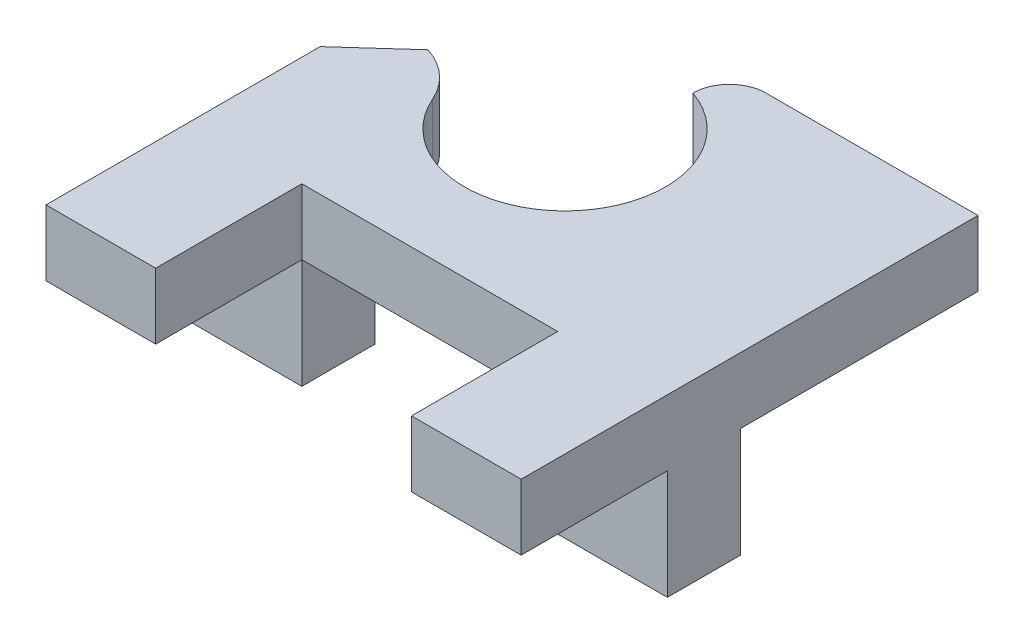
ISO-10303-21;
HEADER;
FILE_DESCRIPTION(('STEP AP214'),'2;1');
FILE_NAME('part.step','',(''),(''),'','','');
FILE_SCHEMA(('AUTOMOTIVE_DESIGN { 1 0 10303 214 1 1 1 1 }'));
ENDSEC;
DATA;
#1=APPLICATION_CONTEXT('core data for automotive mechanical design processes');
#2=APPLICATION_PROTOCOL_DEFINITION('international standard','automotive_design',2000,#1);
#3=PRODUCT_CONTEXT('',#1,'mechanical');
#4=PRODUCT('Part','Part','',(#3));
#5=PRODUCT_RELATED_PRODUCT_CATEGORY('part','',(#4));
#6=PRODUCT_DEFINITION_FORMATION('','',#4);
#7=PRODUCT_DEFINITION_CONTEXT('part definition',#1,'design');
#8=PRODUCT_DEFINITION('design','',#6,#7);
#9=PRODUCT_DEFINITION_SHAPE('','',#8);
#10=(LENGTH_UNIT() NAMED_UNIT(*) SI_UNIT(.MILLI.,.METRE.));
#11=(NAMED_UNIT(*) PLANE_ANGLE_UNIT() SI_UNIT($,.RADIAN.));
#12=(NAMED_UNIT(*) SI_UNIT($,.STERADIAN.) SOLID_ANGLE_UNIT());
#13=UNCERTAINTY_MEASURE_WITH_UNIT(LENGTH_MEASURE(1.E-05),#10,'distance_accuracy_value','');
#14=(GEOMETRIC_REPRESENTATION_CONTEXT(3) GLOBAL_UNCERTAINTY_ASSIGNED_CONTEXT((#13)) GLOBAL_UNIT_ASSIGNED_CONTEXT((#10,
#11,#12)) REPRESENTATION_CONTEXT('',''));
#15=CARTESIAN_POINT('',(0.,0.,0.));
#16=DIRECTION('',(0.,0.,1.));
#17=DIRECTION('',(1.,0.,0.));
#18=AXIS2_PLACEMENT_3D('',#15,#16,#17);
#19=CARTESIAN_POINT('',(-1.2,0.,-4.9));
#20=DIRECTION('',(0.,1.,0.));
#21=DIRECTION('',(0.,0.,1.));
#22=AXIS2_PLACEMENT_3D('',#19,#20,#21);
#23=PLANE('',#22);
#24=DIRECTION('',(-1.,0.,0.));
#25=VECTOR('',#24,1.);
#26=CARTESIAN_POINT('',(-3.5,0.,0.));
#27=LINE('',#26,#25);
#28=CARTESIAN_POINT('',(-3.5,0.,0.));
#29=VERTEX_POINT('',#28);
#30=CARTESIAN_POINT('',(-6.5,0.,0.));
#31=VERTEX_POINT('',#30);
#32=EDGE_CURVE('E476',#29,#31,#27,.T.);
#33=ORIENTED_EDGE('',*,*,#32,.F.);
#34=DIRECTION('',(0.,0.,-1.));
#35=VECTOR('',#34,1.);
#36=CARTESIAN_POINT('',(-3.5,0.,0.));
#37=LINE('',#36,#35);
#38=CARTESIAN_POINT('',(-3.5,0.,4.));
#39=VERTEX_POINT('',#38);
#40=EDGE_CURVE('E253',#39,#29,#37,.T.);
#41=ORIENTED_EDGE('',*,*,#40,.F.);
#42=DIRECTION('',(1.,0.,0.));
#43=VECTOR('',#42,1.);
#44=CARTESIAN_POINT('',(-6.5,0.,4.));
#45=LINE('',#44,#43);
#46=CARTESIAN_POINT('',(-6.5,0.,4.));
#47=VERTEX_POINT('',#46);
#48=EDGE_CURVE('E251',#47,#39,#45,.T.);
#49=ORIENTED_EDGE('',*,*,#48,.F.);
#50=DIRECTION('',(0.,0.,1.));
#51=VECTOR('',#50,1.);
#52=CARTESIAN_POINT('',(-6.5,0.,0.));
#53=LINE('',#52,#51);
#54=EDGE_CURVE('E247',#31,#47,#53,.T.);
#55=ORIENTED_EDGE('',*,*,#54,.F.);
#56=EDGE_LOOP('',(#33,#41,#49,#55));
#57=FACE_BOUND('',#56,.T.);
#58=ADVANCED_FACE('F33',(#57),#23,.F.);
#59=DIRECTION('',(0.,0.,1.));
#60=VECTOR('',#59,1.);
#61=CARTESIAN_POINT('',(-3.5,0.,0.));
#62=LINE('',#61,#60);
#63=CARTESIAN_POINT('',(-3.5,0.,-2.));
#64=VERTEX_POINT('',#63);
#65=EDGE_CURVE('E183',#64,#29,#62,.T.);
#66=ORIENTED_EDGE('',*,*,#65,.F.);
#67=DIRECTION('',(1.,0.,0.));
#68=VECTOR('',#67,1.);
#69=CARTESIAN_POINT('',(-3.5,0.,-2.));
#70=LINE('',#69,#68);
#71=CARTESIAN_POINT('',(-6.5,0.,-2.));
#72=VERTEX_POINT('',#71);
#73=EDGE_CURVE('E179',#72,#64,#70,.T.);
#74=ORIENTED_EDGE('',*,*,#73,.F.);
#75=CARTESIAN_POINT('',(-6.5,0.,-3.5));
#76=VERTEX_POINT('',#75);
#77=EDGE_CURVE('E248',#76,#72,#53,.T.);
#78=ORIENTED_EDGE('',*,*,#77,.F.);
#79=DIRECTION('',(-0.742102642751139,0.,0.67028625796877));
#80=VECTOR('',#79,1.);
#81=CARTESIAN_POINT('',(-4.95,0.,-4.9));
#82=LINE('',#81,#80);
#83=CARTESIAN_POINT('',(-4.95,0.,-4.9));
#84=VERTEX_POINT('',#83);
#85=EDGE_CURVE('E244',#84,#76,#82,.T.);
#86=ORIENTED_EDGE('',*,*,#85,.F.);
#87=CARTESIAN_POINT('',(-5.55,0.,-2.99212159716611));
#88=DIRECTION('',(0.,1.,0.));
#89=DIRECTION('',(0.,0.,1.));
#90=AXIS2_PLACEMENT_3D('',#87,#88,#89);
#91=CIRCLE('',#90,2.);
#92=CARTESIAN_POINT('',(-3.71842105263158,0.,-3.79543881941196));
#93=VERTEX_POINT('',#92);
#94=EDGE_CURVE('E299',#84,#93,#91,.F.);
#95=ORIENTED_EDGE('',*,*,#94,.T.);
#96=CARTESIAN_POINT('',(-1.2,0.,-4.9));
#97=DIRECTION('',(0.,-1.,0.));
#98=DIRECTION('',(0.,0.,1.));
#99=AXIS2_PLACEMENT_3D('',#96,#97,#98);
#100=CIRCLE('',#99,2.75);
#101=CARTESIAN_POINT('',(-0.3,0.,-7.49855729203726));
#102=VERTEX_POINT('',#101);
#103=EDGE_CURVE('E217',#102,#93,#100,.T.);
#104=ORIENTED_EDGE('',*,*,#103,.F.);
#105=CARTESIAN_POINT('',(0.7,0.,-7.49855729203726));
#106=DIRECTION('',(0.,1.,0.));
#107=DIRECTION('',(0.,0.,1.));
#108=AXIS2_PLACEMENT_3D('',#105,#106,#107);
#109=CIRCLE('',#108,1.);
#110=CARTESIAN_POINT('',(0.7,0.,-8.49855729203726));
#111=VERTEX_POINT('',#110);
#112=EDGE_CURVE('E305',#102,#111,#109,.F.);
#113=ORIENTED_EDGE('',*,*,#112,.T.);
#114=DIRECTION('',(-1.,0.,0.));
#115=VECTOR('',#114,1.);
#116=CARTESIAN_POINT('',(-0.3,0.,-8.49855729203726));
#117=LINE('',#116,#115);
#118=CARTESIAN_POINT('',(6.5,0.,-8.49855729203726));
#119=VERTEX_POINT('',#118);
#120=EDGE_CURVE('E222',#119,#111,#117,.T.);
#121=ORIENTED_EDGE('',*,*,#120,.F.);
#122=DIRECTION('',(0.,0.,-1.));
#123=VECTOR('',#122,1.);
#124=CARTESIAN_POINT('',(6.5,0.,-8.49855729203726));
#125=LINE('',#124,#123);
#126=CARTESIAN_POINT('',(6.5,0.,-2.));
#127=VERTEX_POINT('',#126);
#128=EDGE_CURVE('E264',#127,#119,#125,.T.);
#129=ORIENTED_EDGE('',*,*,#128,.F.);
#130=DIRECTION('',(1.,0.,0.));
#131=VECTOR('',#130,1.);
#132=CARTESIAN_POINT('',(3.5,0.,-2.));
#133=LINE('',#132,#131);
#134=CARTESIAN_POINT('',(3.5,0.,-2.));
#135=VERTEX_POINT('',#134);
#136=EDGE_CURVE('E56',#135,#127,#133,.T.);
#137=ORIENTED_EDGE('',*,*,#136,.F.);
#138=DIRECTION('',(0.,0.,-1.));
#139=VECTOR('',#138,1.);
#140=CARTESIAN_POINT('',(3.5,0.,0.));
#141=LINE('',#140,#139);
#142=CARTESIAN_POINT('',(3.5,0.,0.));
#143=VERTEX_POINT('',#142);
#144=EDGE_CURVE('E185',#143,#135,#141,.T.);
#145=ORIENTED_EDGE('',*,*,#144,.F.);
#146=DIRECTION('',(1.,0.,0.));
#147=VECTOR('',#146,1.);
#148=CARTESIAN_POINT('',(3.5,0.,0.));
#149=LINE('',#148,#147);
#150=EDGE_CURVE('E256',#29,#143,#149,.T.);
#151=ORIENTED_EDGE('',*,*,#150,.F.);
#152=EDGE_LOOP('',(#66,#74,#78,#86,#95,#104,#113,#121,#129,#137,#145,#151));
#153=FACE_BOUND('',#152,.T.);
#154=ADVANCED_FACE('F332',(#153),#23,.F.);
#155=DIRECTION('',(-1.,0.,0.));
#156=VECTOR('',#155,1.);
#157=CARTESIAN_POINT('',(3.5,0.,0.));
#158=LINE('',#157,#156);
#159=CARTESIAN_POINT('',(6.5,0.,0.));
#160=VERTEX_POINT('',#159);
#161=EDGE_CURVE('E197',#160,#143,#158,.T.);
#162=ORIENTED_EDGE('',*,*,#161,.F.);
#163=CARTESIAN_POINT('',(6.5,0.,4.));
#164=VERTEX_POINT('',#163);
#165=EDGE_CURVE('E265',#164,#160,#125,.T.);
#166=ORIENTED_EDGE('',*,*,#165,.F.);
#167=DIRECTION('',(1.,0.,0.));
#168=VECTOR('',#167,1.);
#169=CARTESIAN_POINT('',(6.5,0.,4.));
#170=LINE('',#169,#168);
#171=CARTESIAN_POINT('',(3.5,0.,4.));
#172=VERTEX_POINT('',#171);
#173=EDGE_CURVE('E261',#172,#164,#170,.T.);
#174=ORIENTED_EDGE('',*,*,#173,.F.);
#175=DIRECTION('',(0.,0.,1.));
#176=VECTOR('',#175,1.);
#177=CARTESIAN_POINT('',(3.5,0.,0.));
#178=LINE('',#177,#176);
#179=EDGE_CURVE('E259',#143,#172,#178,.T.);
#180=ORIENTED_EDGE('',*,*,#179,.F.);
#181=EDGE_LOOP('',(#162,#166,#174,#180));
#182=FACE_BOUND('',#181,.T.);
#183=ADVANCED_FACE('F379',(#182),#23,.F.);
#184=CARTESIAN_POINT('',(-1.2,1.8,-4.9));
#185=DIRECTION('',(0.,-1.,0.));
#186=DIRECTION('',(0.,0.,-1.));
#187=AXIS2_PLACEMENT_3D('',#184,#185,#186);
#188=CYLINDRICAL_SURFACE('',#187,2.75);
#189=ORIENTED_EDGE('',*,*,#103,.T.);
#190=DIRECTION('',(0.,-1.,0.));
#191=VECTOR('',#190,1.);
#192=CARTESIAN_POINT('',(-3.71842105263158,1.8,-3.79543881941196));
#193=LINE('',#192,#191);
#194=CARTESIAN_POINT('',(-3.71842105263158,1.8,-3.79543881941196));
#195=VERTEX_POINT('',#194);
#196=EDGE_CURVE('E301',#93,#195,#193,.F.);
#197=ORIENTED_EDGE('',*,*,#196,.T.);
#198=CARTESIAN_POINT('',(-1.2,1.8,-4.9));
#199=DIRECTION('',(0.,-1.,0.));
#200=DIRECTION('',(0.,0.,1.));
#201=AXIS2_PLACEMENT_3D('',#198,#199,#200);
#202=CIRCLE('',#201,2.75);
#203=CARTESIAN_POINT('',(-0.3,1.8,-7.49855729203726));
#204=VERTEX_POINT('',#203);
#205=EDGE_CURVE('E218',#204,#195,#202,.T.);
#206=ORIENTED_EDGE('',*,*,#205,.F.);
#207=DIRECTION('',(0.,-1.,0.));
#208=VECTOR('',#207,1.);
#209=CARTESIAN_POINT('',(-0.3,1.8,-7.49855729203726));
#210=LINE('',#209,#208);
#211=EDGE_CURVE('E241',#204,#102,#210,.T.);
#212=ORIENTED_EDGE('',*,*,#211,.T.);
#213=EDGE_LOOP('',(#189,#197,#206,#212));
#214=FACE_BOUND('',#213,.T.);
#215=ADVANCED_FACE('F321',(#214),#188,.F.);
#216=CARTESIAN_POINT('',(-4.95,1.8,-4.9));
#217=DIRECTION('',(0.67028625796877,0.,0.742102642751139));
#218=DIRECTION('',(0.742102642751139,0.,-0.67028625796877));
#219=AXIS2_PLACEMENT_3D('',#216,#217,#218);
#220=PLANE('',#219);
#221=ORIENTED_EDGE('',*,*,#85,.T.);
#222=DIRECTION('',(0.,-1.,0.));
#223=VECTOR('',#222,1.);
#224=CARTESIAN_POINT('',(-6.5,1.8,-3.5));
#225=LINE('',#224,#223);
#226=CARTESIAN_POINT('',(-6.5,1.8,-3.5));
#227=VERTEX_POINT('',#226);
#228=EDGE_CURVE('E293',#227,#76,#225,.T.);
#229=ORIENTED_EDGE('',*,*,#228,.F.);
#230=DIRECTION('',(-0.742102642751139,0.,0.67028625796877));
#231=VECTOR('',#230,1.);
#232=CARTESIAN_POINT('',(-4.95,1.8,-4.9));
#233=LINE('',#232,#231);
#234=CARTESIAN_POINT('',(-4.95,1.8,-4.9));
#235=VERTEX_POINT('',#234);
#236=EDGE_CURVE('E221',#235,#227,#233,.T.);
#237=ORIENTED_EDGE('',*,*,#236,.F.);
#238=DIRECTION('',(0.,-1.,0.));
#239=VECTOR('',#238,1.);
#240=CARTESIAN_POINT('',(-4.95,1.8,-4.9));
#241=LINE('',#240,#239);
#242=EDGE_CURVE('E296',#235,#84,#241,.T.);
#243=ORIENTED_EDGE('',*,*,#242,.T.);
#244=EDGE_LOOP('',(#221,#229,#237,#243));
#245=FACE_BOUND('',#244,.T.);
#246=ADVANCED_FACE('F330',(#245),#220,.F.);
#247=CARTESIAN_POINT('',(-6.5,1.8,0.));
#248=DIRECTION('',(1.,0.,0.));
#249=DIRECTION('',(0.,0.,-1.));
#250=AXIS2_PLACEMENT_3D('',#247,#248,#249);
#251=PLANE('',#250);
#252=ORIENTED_EDGE('',*,*,#77,.T.);
#253=DIRECTION('',(0.,1.,0.));
#254=VECTOR('',#253,1.);
#255=CARTESIAN_POINT('',(-6.5,-3.,-2.));
#256=LINE('',#255,#254);
#257=CARTESIAN_POINT('',(-6.5,-3.,-2.));
#258=VERTEX_POINT('',#257);
#259=EDGE_CURVE('E189',#258,#72,#256,.T.);
#260=ORIENTED_EDGE('',*,*,#259,.F.);
#261=DIRECTION('',(0.,0.,-1.));
#262=VECTOR('',#261,1.);
#263=CARTESIAN_POINT('',(-6.5,-3.,0.));
#264=LINE('',#263,#262);
#265=CARTESIAN_POINT('',(-6.5,-3.,0.));
#266=VERTEX_POINT('',#265);
#267=EDGE_CURVE('E169',#266,#258,#264,.T.);
#268=ORIENTED_EDGE('',*,*,#267,.F.);
#269=DIRECTION('',(0.,1.,0.));
#270=VECTOR('',#269,1.);
#271=CARTESIAN_POINT('',(-6.5,-3.,0.));
#272=LINE('',#271,#270);
#273=EDGE_CURVE('E48',#266,#31,#272,.T.);
#274=ORIENTED_EDGE('',*,*,#273,.T.);
#275=ORIENTED_EDGE('',*,*,#54,.T.);
#276=DIRECTION('',(0.,-1.,0.));
#277=VECTOR('',#276,1.);
#278=CARTESIAN_POINT('',(-6.5,1.8,4.));
#279=LINE('',#278,#277);
#280=CARTESIAN_POINT('',(-6.5,1.8,4.));
#281=VERTEX_POINT('',#280);
#282=EDGE_CURVE('E290',#281,#47,#279,.T.);
#283=ORIENTED_EDGE('',*,*,#282,.F.);
#284=DIRECTION('',(0.,0.,1.));
#285=VECTOR('',#284,1.);
#286=CARTESIAN_POINT('',(-6.5,1.8,-2.5));
#287=LINE('',#286,#285);
#288=EDGE_CURVE('E224',#227,#281,#287,.T.);
#289=ORIENTED_EDGE('',*,*,#288,.F.);
#290=ORIENTED_EDGE('',*,*,#228,.T.);
#291=EDGE_LOOP('',(#252,#260,#268,#274,#275,#283,#289,#290));
#292=FACE_BOUND('',#291,.T.);
#293=ADVANCED_FACE('F335',(#292),#251,.F.);
#294=CARTESIAN_POINT('',(-6.5,1.8,4.));
#295=DIRECTION('',(0.,0.,-1.));
#296=DIRECTION('',(-1.,0.,0.));
#297=AXIS2_PLACEMENT_3D('',#294,#295,#296);
#298=PLANE('',#297);
#299=ORIENTED_EDGE('',*,*,#48,.T.);
#300=DIRECTION('',(0.,-1.,0.));
#301=VECTOR('',#300,1.);
#302=CARTESIAN_POINT('',(-3.5,1.8,4.));
#303=LINE('',#302,#301);
#304=CARTESIAN_POINT('',(-3.5,1.8,4.));
#305=VERTEX_POINT('',#304);
#306=EDGE_CURVE('E287',#305,#39,#303,.T.);
#307=ORIENTED_EDGE('',*,*,#306,.F.);
#308=DIRECTION('',(1.,0.,0.));
#309=VECTOR('',#308,1.);
#310=CARTESIAN_POINT('',(-6.5,1.8,4.));
#311=LINE('',#310,#309);
#312=EDGE_CURVE('E226',#281,#305,#311,.T.);
#313=ORIENTED_EDGE('',*,*,#312,.F.);
#314=ORIENTED_EDGE('',*,*,#282,.T.);
#315=EDGE_LOOP('',(#299,#307,#313,#314));
#316=FACE_BOUND('',#315,.T.);
#317=ADVANCED_FACE('F343',(#316),#298,.F.);
#318=CARTESIAN_POINT('',(-3.5,1.8,0.));
#319=DIRECTION('',(-1.,0.,0.));
#320=DIRECTION('',(0.,0.,1.));
#321=AXIS2_PLACEMENT_3D('',#318,#319,#320);
#322=PLANE('',#321);
#323=ORIENTED_EDGE('',*,*,#40,.T.);
#324=DIRECTION('',(0.,-1.,0.));
#325=VECTOR('',#324,1.);
#326=CARTESIAN_POINT('',(-3.5,1.8,0.));
#327=LINE('',#326,#325);
#328=CARTESIAN_POINT('',(-3.5,1.8,0.));
#329=VERTEX_POINT('',#328);
#330=EDGE_CURVE('E284',#329,#29,#327,.T.);
#331=ORIENTED_EDGE('',*,*,#330,.F.);
#332=DIRECTION('',(0.,0.,-1.));
#333=VECTOR('',#332,1.);
#334=CARTESIAN_POINT('',(-3.5,1.8,0.));
#335=LINE('',#334,#333);
#336=EDGE_CURVE('E228',#305,#329,#335,.T.);
#337=ORIENTED_EDGE('',*,*,#336,.F.);
#338=ORIENTED_EDGE('',*,*,#306,.T.);
#339=EDGE_LOOP('',(#323,#331,#337,#338));
#340=FACE_BOUND('',#339,.T.);
#341=ADVANCED_FACE('F347',(#340),#322,.F.);
#342=CARTESIAN_POINT('',(3.5,1.8,0.));
#343=DIRECTION('',(0.,0.,-1.));
#344=DIRECTION('',(-1.,0.,0.));
#345=AXIS2_PLACEMENT_3D('',#342,#343,#344);
#346=PLANE('',#345);
#347=ORIENTED_EDGE('',*,*,#150,.T.);
#348=DIRECTION('',(0.,-1.,0.));
#349=VECTOR('',#348,1.);
#350=CARTESIAN_POINT('',(3.5,1.8,0.));
#351=LINE('',#350,#349);
#352=CARTESIAN_POINT('',(3.5,1.8,0.));
#353=VERTEX_POINT('',#352);
#354=EDGE_CURVE('E281',#353,#143,#351,.T.);
#355=ORIENTED_EDGE('',*,*,#354,.F.);
#356=DIRECTION('',(1.,0.,0.));
#357=VECTOR('',#356,1.);
#358=CARTESIAN_POINT('',(3.5,1.8,0.));
#359=LINE('',#358,#357);
#360=EDGE_CURVE('E230',#329,#353,#359,.T.);
#361=ORIENTED_EDGE('',*,*,#360,.F.);
#362=ORIENTED_EDGE('',*,*,#330,.T.);
#363=EDGE_LOOP('',(#347,#355,#361,#362));
#364=FACE_BOUND('',#363,.T.);
#365=ADVANCED_FACE('F352',(#364),#346,.F.);
#366=CARTESIAN_POINT('',(3.5,1.8,0.));
#367=DIRECTION('',(1.,0.,0.));
#368=DIRECTION('',(0.,0.,-1.));
#369=AXIS2_PLACEMENT_3D('',#366,#367,#368);
#370=PLANE('',#369);
#371=ORIENTED_EDGE('',*,*,#179,.T.);
#372=DIRECTION('',(0.,-1.,0.));
#373=VECTOR('',#372,1.);
#374=CARTESIAN_POINT('',(3.5,1.8,4.));
#375=LINE('',#374,#373);
#376=CARTESIAN_POINT('',(3.5,1.8,4.));
#377=VERTEX_POINT('',#376);
#378=EDGE_CURVE('E278',#377,#172,#375,.T.);
#379=ORIENTED_EDGE('',*,*,#378,.F.);
#380=DIRECTION('',(0.,0.,1.));
#381=VECTOR('',#380,1.);
#382=CARTESIAN_POINT('',(3.5,1.8,0.));
#383=LINE('',#382,#381);
#384=EDGE_CURVE('E232',#353,#377,#383,.T.);
#385=ORIENTED_EDGE('',*,*,#384,.F.);
#386=ORIENTED_EDGE('',*,*,#354,.T.);
#387=EDGE_LOOP('',(#371,#379,#385,#386));
#388=FACE_BOUND('',#387,.T.);
#389=ADVANCED_FACE('F358',(#388),#370,.F.);
#390=CARTESIAN_POINT('',(6.5,1.8,4.));
#391=DIRECTION('',(0.,0.,-1.));
#392=DIRECTION('',(-1.,0.,0.));
#393=AXIS2_PLACEMENT_3D('',#390,#391,#392);
#394=PLANE('',#393);
#395=ORIENTED_EDGE('',*,*,#173,.T.);
#396=DIRECTION('',(0.,-1.,0.));
#397=VECTOR('',#396,1.);
#398=CARTESIAN_POINT('',(6.5,1.8,4.));
#399=LINE('',#398,#397);
#400=CARTESIAN_POINT('',(6.5,1.8,4.));
#401=VERTEX_POINT('',#400);
#402=EDGE_CURVE('E275',#401,#164,#399,.T.);
#403=ORIENTED_EDGE('',*,*,#402,.F.);
#404=DIRECTION('',(1.,0.,0.));
#405=VECTOR('',#404,1.);
#406=CARTESIAN_POINT('',(6.5,1.8,4.));
#407=LINE('',#406,#405);
#408=EDGE_CURVE('E234',#377,#401,#407,.T.);
#409=ORIENTED_EDGE('',*,*,#408,.F.);
#410=ORIENTED_EDGE('',*,*,#378,.T.);
#411=EDGE_LOOP('',(#395,#403,#409,#410));
#412=FACE_BOUND('',#411,.T.);
#413=ADVANCED_FACE('F362',(#412),#394,.F.);
#414=CARTESIAN_POINT('',(6.5,1.8,-8.49855729203726));
#415=DIRECTION('',(-1.,0.,0.));
#416=DIRECTION('',(0.,0.,1.));
#417=AXIS2_PLACEMENT_3D('',#414,#415,#416);
#418=PLANE('',#417);
#419=ORIENTED_EDGE('',*,*,#165,.T.);
#420=DIRECTION('',(0.,1.,0.));
#421=VECTOR('',#420,1.);
#422=CARTESIAN_POINT('',(6.5,-3.,0.));
#423=LINE('',#422,#421);
#424=CARTESIAN_POINT('',(6.5,-3.,0.));
#425=VERTEX_POINT('',#424);
#426=EDGE_CURVE('E209',#425,#160,#423,.T.);
#427=ORIENTED_EDGE('',*,*,#426,.F.);
#428=DIRECTION('',(0.,0.,1.));
#429=VECTOR('',#428,1.);
#430=CARTESIAN_POINT('',(6.5,-3.,0.));
#431=LINE('',#430,#429);
#432=CARTESIAN_POINT('',(6.5,-3.,-2.));
#433=VERTEX_POINT('',#432);
#434=EDGE_CURVE('E199',#433,#425,#431,.T.);
#435=ORIENTED_EDGE('',*,*,#434,.F.);
#436=DIRECTION('',(0.,1.,0.));
#437=VECTOR('',#436,1.);
#438=CARTESIAN_POINT('',(6.5,-3.,-2.));
#439=LINE('',#438,#437);
#440=EDGE_CURVE('E212',#433,#127,#439,.T.);
#441=ORIENTED_EDGE('',*,*,#440,.T.);
#442=ORIENTED_EDGE('',*,*,#128,.T.);
#443=DIRECTION('',(0.,-1.,0.));
#444=VECTOR('',#443,1.);
#445=CARTESIAN_POINT('',(6.5,1.8,-8.49855729203726));
#446=LINE('',#445,#444);
#447=CARTESIAN_POINT('',(6.5,1.8,-8.49855729203726));
#448=VERTEX_POINT('',#447);
#449=EDGE_CURVE('E272',#448,#119,#446,.T.);
#450=ORIENTED_EDGE('',*,*,#449,.F.);
#451=DIRECTION('',(0.,0.,-1.));
#452=VECTOR('',#451,1.);
#453=CARTESIAN_POINT('',(6.5,1.8,0.));
#454=LINE('',#453,#452);
#455=EDGE_CURVE('E236',#401,#448,#454,.T.);
#456=ORIENTED_EDGE('',*,*,#455,.F.);
#457=ORIENTED_EDGE('',*,*,#402,.T.);
#458=EDGE_LOOP('',(#419,#427,#435,#441,#442,#450,#456,#457));
#459=FACE_BOUND('',#458,.T.);
#460=ADVANCED_FACE('F364',(#459),#418,.F.);
#461=CARTESIAN_POINT('',(-0.3,1.8,-8.49855729203726));
#462=DIRECTION('',(0.,0.,1.));
#463=DIRECTION('',(1.,0.,0.));
#464=AXIS2_PLACEMENT_3D('',#461,#462,#463);
#465=PLANE('',#464);
#466=ORIENTED_EDGE('',*,*,#120,.T.);
#467=DIRECTION('',(0.,-1.,0.));
#468=VECTOR('',#467,1.);
#469=CARTESIAN_POINT('',(0.7,1.8,-8.49855729203726));
#470=LINE('',#469,#468);
#471=CARTESIAN_POINT('',(0.7,1.8,-8.49855729203726));
#472=VERTEX_POINT('',#471);
#473=EDGE_CURVE('E41',#111,#472,#470,.F.);
#474=ORIENTED_EDGE('',*,*,#473,.T.);
#475=DIRECTION('',(-1.,0.,0.));
#476=VECTOR('',#475,1.);
#477=CARTESIAN_POINT('',(-0.3,1.8,-8.49855729203726));
#478=LINE('',#477,#476);
#479=EDGE_CURVE('E238',#448,#472,#478,.T.);
#480=ORIENTED_EDGE('',*,*,#479,.F.);
#481=ORIENTED_EDGE('',*,*,#449,.T.);
#482=EDGE_LOOP('',(#466,#474,#480,#481));
#483=FACE_BOUND('',#482,.T.);
#484=ADVANCED_FACE('F309',(#483),#465,.F.);
#485=CARTESIAN_POINT('',(-1.2,1.8,-4.9));
#486=DIRECTION('',(0.,1.,0.));
#487=DIRECTION('',(0.,0.,1.));
#488=AXIS2_PLACEMENT_3D('',#485,#486,#487);
#489=PLANE('',#488);
#490=ORIENTED_EDGE('',*,*,#479,.T.);
#491=CARTESIAN_POINT('',(0.7,1.8,-7.49855729203726));
#492=DIRECTION('',(0.,1.,0.));
#493=DIRECTION('',(0.,0.,1.));
#494=AXIS2_PLACEMENT_3D('',#491,#492,#493);
#495=CIRCLE('',#494,1.);
#496=EDGE_CURVE('E11',#472,#204,#495,.T.);
#497=ORIENTED_EDGE('',*,*,#496,.T.);
#498=ORIENTED_EDGE('',*,*,#205,.T.);
#499=CARTESIAN_POINT('',(-5.55,1.8,-2.99212159716611));
#500=DIRECTION('',(0.,1.,0.));
#501=DIRECTION('',(0.,0.,1.));
#502=AXIS2_PLACEMENT_3D('',#499,#500,#501);
#503=CIRCLE('',#502,2.);
#504=EDGE_CURVE('E303',#195,#235,#503,.T.);
#505=ORIENTED_EDGE('',*,*,#504,.T.);
#506=ORIENTED_EDGE('',*,*,#236,.T.);
#507=ORIENTED_EDGE('',*,*,#288,.T.);
#508=ORIENTED_EDGE('',*,*,#312,.T.);
#509=ORIENTED_EDGE('',*,*,#336,.T.);
#510=ORIENTED_EDGE('',*,*,#360,.T.);
#511=ORIENTED_EDGE('',*,*,#384,.T.);
#512=ORIENTED_EDGE('',*,*,#408,.T.);
#513=ORIENTED_EDGE('',*,*,#455,.T.);
#514=EDGE_LOOP('',(#490,#497,#498,#505,#506,#507,#508,#509,#510,#511,#512,#513));
#515=FACE_BOUND('',#514,.T.);
#516=ADVANCED_FACE('F314',(#515),#489,.T.);
#517=CARTESIAN_POINT('',(-5.55,1.8,-2.99212159716611));
#518=DIRECTION('',(0.,-1.,0.));
#519=DIRECTION('',(0.,0.,-1.));
#520=AXIS2_PLACEMENT_3D('',#517,#518,#519);
#521=CYLINDRICAL_SURFACE('',#520,2.);
#522=ORIENTED_EDGE('',*,*,#504,.F.);
#523=ORIENTED_EDGE('',*,*,#196,.F.);
#524=ORIENTED_EDGE('',*,*,#94,.F.);
#525=ORIENTED_EDGE('',*,*,#242,.F.);
#526=EDGE_LOOP('',(#522,#523,#524,#525));
#527=FACE_BOUND('',#526,.T.);
#528=ADVANCED_FACE('F327',(#527),#521,.T.);
#529=CARTESIAN_POINT('',(0.7,1.8,-7.49855729203726));
#530=DIRECTION('',(0.,-1.,0.));
#531=DIRECTION('',(0.,0.,-1.));
#532=AXIS2_PLACEMENT_3D('',#529,#530,#531);
#533=CYLINDRICAL_SURFACE('',#532,1.);
#534=ORIENTED_EDGE('',*,*,#496,.F.);
#535=ORIENTED_EDGE('',*,*,#473,.F.);
#536=ORIENTED_EDGE('',*,*,#112,.F.);
#537=ORIENTED_EDGE('',*,*,#211,.F.);
#538=EDGE_LOOP('',(#534,#535,#536,#537));
#539=FACE_BOUND('',#538,.T.);
#540=ADVANCED_FACE('F35',(#539),#533,.T.);
#541=CARTESIAN_POINT('',(3.5,-3.,0.));
#542=DIRECTION('',(1.,0.,0.));
#543=DIRECTION('',(0.,0.,-1.));
#544=AXIS2_PLACEMENT_3D('',#541,#542,#543);
#545=PLANE('',#544);
#546=ORIENTED_EDGE('',*,*,#144,.T.);
#547=DIRECTION('',(0.,1.,0.));
#548=VECTOR('',#547,1.);
#549=CARTESIAN_POINT('',(3.5,-3.,-2.));
#550=LINE('',#549,#548);
#551=CARTESIAN_POINT('',(3.5,-3.,-2.));
#552=VERTEX_POINT('',#551);
#553=EDGE_CURVE('E215',#552,#135,#550,.T.);
#554=ORIENTED_EDGE('',*,*,#553,.F.);
#555=DIRECTION('',(0.,0.,-1.));
#556=VECTOR('',#555,1.);
#557=CARTESIAN_POINT('',(3.5,-3.,0.));
#558=LINE('',#557,#556);
#559=CARTESIAN_POINT('',(3.5,-3.,0.));
#560=VERTEX_POINT('',#559);
#561=EDGE_CURVE('E193',#560,#552,#558,.T.);
#562=ORIENTED_EDGE('',*,*,#561,.F.);
#563=DIRECTION('',(0.,1.,0.));
#564=VECTOR('',#563,1.);
#565=CARTESIAN_POINT('',(3.5,-3.,0.));
#566=LINE('',#565,#564);
#567=EDGE_CURVE('E202',#560,#143,#566,.T.);
#568=ORIENTED_EDGE('',*,*,#567,.T.);
#569=EDGE_LOOP('',(#546,#554,#562,#568));
#570=FACE_BOUND('',#569,.T.);
#571=ADVANCED_FACE('F377',(#570),#545,.F.);
#572=CARTESIAN_POINT('',(3.5,-3.,-2.));
#573=DIRECTION('',(0.,0.,1.));
#574=DIRECTION('',(1.,0.,0.));
#575=AXIS2_PLACEMENT_3D('',#572,#573,#574);
#576=PLANE('',#575);
#577=ORIENTED_EDGE('',*,*,#136,.T.);
#578=ORIENTED_EDGE('',*,*,#440,.F.);
#579=DIRECTION('',(1.,0.,0.));
#580=VECTOR('',#579,1.);
#581=CARTESIAN_POINT('',(3.5,-3.,-2.));
#582=LINE('',#581,#580);
#583=EDGE_CURVE('E196',#552,#433,#582,.T.);
#584=ORIENTED_EDGE('',*,*,#583,.F.);
#585=ORIENTED_EDGE('',*,*,#553,.T.);
#586=EDGE_LOOP('',(#577,#578,#584,#585));
#587=FACE_BOUND('',#586,.T.);
#588=ADVANCED_FACE('F367',(#587),#576,.F.);
#589=CARTESIAN_POINT('',(3.5,-3.,0.));
#590=DIRECTION('',(0.,0.,-1.));
#591=DIRECTION('',(-1.,0.,0.));
#592=AXIS2_PLACEMENT_3D('',#589,#590,#591);
#593=PLANE('',#592);
#594=ORIENTED_EDGE('',*,*,#161,.T.);
#595=ORIENTED_EDGE('',*,*,#567,.F.);
#596=DIRECTION('',(-1.,0.,0.));
#597=VECTOR('',#596,1.);
#598=CARTESIAN_POINT('',(3.5,-3.,0.));
#599=LINE('',#598,#597);
#600=EDGE_CURVE('E201',#425,#560,#599,.T.);
#601=ORIENTED_EDGE('',*,*,#600,.F.);
#602=ORIENTED_EDGE('',*,*,#426,.T.);
#603=EDGE_LOOP('',(#594,#595,#601,#602));
#604=FACE_BOUND('',#603,.T.);
#605=ADVANCED_FACE('F381',(#604),#593,.F.);
#606=CARTESIAN_POINT('',(0.,-3.,0.));
#607=DIRECTION('',(0.,-1.,0.));
#608=DIRECTION('',(0.,0.,-1.));
#609=AXIS2_PLACEMENT_3D('',#606,#607,#608);
#610=PLANE('',#609);
#611=ORIENTED_EDGE('',*,*,#561,.T.);
#612=ORIENTED_EDGE('',*,*,#583,.T.);
#613=ORIENTED_EDGE('',*,*,#434,.T.);
#614=ORIENTED_EDGE('',*,*,#600,.T.);
#615=EDGE_LOOP('',(#611,#612,#613,#614));
#616=FACE_BOUND('',#615,.T.);
#617=ADVANCED_FACE('F373',(#616),#610,.T.);
#618=CARTESIAN_POINT('',(-3.5,-3.,0.));
#619=DIRECTION('',(-1.,0.,0.));
#620=DIRECTION('',(0.,0.,1.));
#621=AXIS2_PLACEMENT_3D('',#618,#619,#620);
#622=PLANE('',#621);
#623=ORIENTED_EDGE('',*,*,#65,.T.);
#624=DIRECTION('',(0.,1.,0.));
#625=VECTOR('',#624,1.);
#626=CARTESIAN_POINT('',(-3.5,-3.,0.));
#627=LINE('',#626,#625);
#628=CARTESIAN_POINT('',(-3.5,-3.,0.));
#629=VERTEX_POINT('',#628);
#630=EDGE_CURVE('E166',#629,#29,#627,.T.);
#631=ORIENTED_EDGE('',*,*,#630,.F.);
#632=DIRECTION('',(0.,0.,1.));
#633=VECTOR('',#632,1.);
#634=CARTESIAN_POINT('',(-3.5,-3.,0.));
#635=LINE('',#634,#633);
#636=CARTESIAN_POINT('',(-3.5,-3.,-2.));
#637=VERTEX_POINT('',#636);
#638=EDGE_CURVE('E170',#637,#629,#635,.T.);
#639=ORIENTED_EDGE('',*,*,#638,.F.);
#640=DIRECTION('',(0.,1.,0.));
#641=VECTOR('',#640,1.);
#642=CARTESIAN_POINT('',(-3.5,-3.,-2.));
#643=LINE('',#642,#641);
#644=EDGE_CURVE('E475',#637,#64,#643,.T.);
#645=ORIENTED_EDGE('',*,*,#644,.T.);
#646=EDGE_LOOP('',(#623,#631,#639,#645));
#647=FACE_BOUND('',#646,.T.);
#648=ADVANCED_FACE('F181',(#647),#622,.F.);
#649=CARTESIAN_POINT('',(-3.5,-3.,0.));
#650=DIRECTION('',(0.,0.,-1.));
#651=DIRECTION('',(-1.,0.,0.));
#652=AXIS2_PLACEMENT_3D('',#649,#650,#651);
#653=PLANE('',#652);
#654=ORIENTED_EDGE('',*,*,#32,.T.);
#655=ORIENTED_EDGE('',*,*,#273,.F.);
#656=DIRECTION('',(-1.,0.,0.));
#657=VECTOR('',#656,1.);
#658=CARTESIAN_POINT('',(-3.5,-3.,0.));
#659=LINE('',#658,#657);
#660=EDGE_CURVE('E162',#629,#266,#659,.T.);
#661=ORIENTED_EDGE('',*,*,#660,.F.);
#662=ORIENTED_EDGE('',*,*,#630,.T.);
#663=EDGE_LOOP('',(#654,#655,#661,#662));
#664=FACE_BOUND('',#663,.T.);
#665=ADVANCED_FACE('F164',(#664),#653,.F.);
#666=CARTESIAN_POINT('',(-3.5,-3.,-2.));
#667=DIRECTION('',(0.,0.,1.));
#668=DIRECTION('',(1.,0.,0.));
#669=AXIS2_PLACEMENT_3D('',#666,#667,#668);
#670=PLANE('',#669);
#671=ORIENTED_EDGE('',*,*,#73,.T.);
#672=ORIENTED_EDGE('',*,*,#644,.F.);
#673=DIRECTION('',(1.,0.,0.));
#674=VECTOR('',#673,1.);
#675=CARTESIAN_POINT('',(-3.5,-3.,-2.));
#676=LINE('',#675,#674);
#677=EDGE_CURVE('E175',#258,#637,#676,.T.);
#678=ORIENTED_EDGE('',*,*,#677,.F.);
#679=ORIENTED_EDGE('',*,*,#259,.T.);
#680=EDGE_LOOP('',(#671,#672,#678,#679));
#681=FACE_BOUND('',#680,.T.);
#682=ADVANCED_FACE('F454',(#681),#670,.F.);
#683=CARTESIAN_POINT('',(0.,-3.,0.));
#684=DIRECTION('',(0.,1.,0.));
#685=DIRECTION('',(0.,0.,1.));
#686=AXIS2_PLACEMENT_3D('',#683,#684,#685);
#687=PLANE('',#686);
#688=ORIENTED_EDGE('',*,*,#638,.T.);
#689=ORIENTED_EDGE('',*,*,#660,.T.);
#690=ORIENTED_EDGE('',*,*,#267,.T.);
#691=ORIENTED_EDGE('',*,*,#677,.T.);
#692=EDGE_LOOP('',(#688,#689,#690,#691));
#693=FACE_BOUND('',#692,.T.);
#694=ADVANCED_FACE('F173',(#693),#687,.F.);
#695=CLOSED_SHELL('',(#58,#154,#183,#215,#246,#293,#317,#341,#365,#389,#413,#460,#484,#516,#528,
#540,#571,#588,#605,#617,#648,#665,#682,#694));
#696=MANIFOLD_SOLID_BREP('B2',#695);
#697=ADVANCED_BREP_SHAPE_REPRESENTATION('',(#18,#696),#14);
#698=SHAPE_DEFINITION_REPRESENTATION(#9,#697);
ENDSEC;
END-ISO-10303-21;
